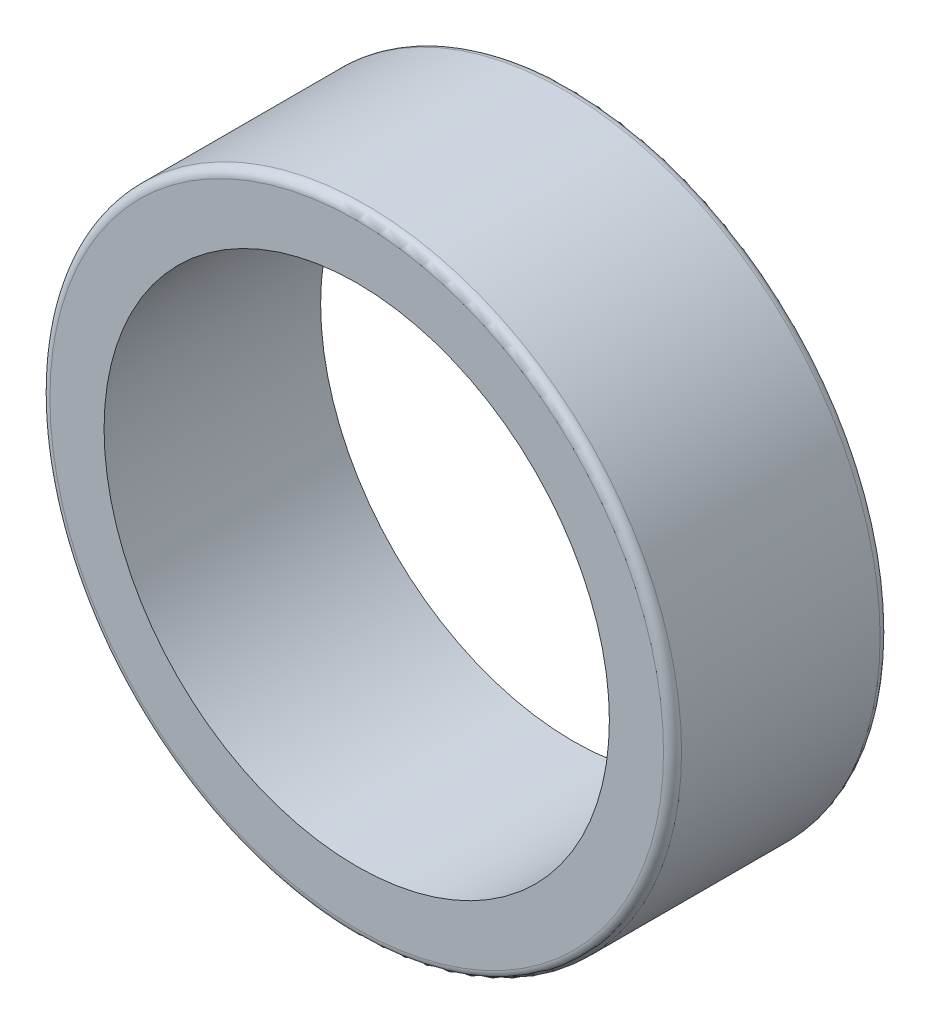
ISO-10303-21;
HEADER;
FILE_DESCRIPTION(('STEP AP214'),'2;1');
FILE_NAME('part.step','',(''),(''),'','','');
FILE_SCHEMA(('AUTOMOTIVE_DESIGN { 1 0 10303 214 1 1 1 1 }'));
ENDSEC;
DATA;
#1=APPLICATION_CONTEXT('core data for automotive mechanical design processes');
#2=APPLICATION_PROTOCOL_DEFINITION('international standard','automotive_design',2000,#1);
#3=PRODUCT_CONTEXT('',#1,'mechanical');
#4=PRODUCT('Part','Part','',(#3));
#5=PRODUCT_RELATED_PRODUCT_CATEGORY('part','',(#4));
#6=PRODUCT_DEFINITION_FORMATION('','',#4);
#7=PRODUCT_DEFINITION_CONTEXT('part definition',#1,'design');
#8=PRODUCT_DEFINITION('design','',#6,#7);
#9=PRODUCT_DEFINITION_SHAPE('','',#8);
#10=(LENGTH_UNIT() NAMED_UNIT(*) SI_UNIT(.MILLI.,.METRE.));
#11=(NAMED_UNIT(*) PLANE_ANGLE_UNIT() SI_UNIT($,.RADIAN.));
#12=(NAMED_UNIT(*) SI_UNIT($,.STERADIAN.) SOLID_ANGLE_UNIT());
#13=UNCERTAINTY_MEASURE_WITH_UNIT(LENGTH_MEASURE(1.E-05),#10,'distance_accuracy_value','');
#14=(GEOMETRIC_REPRESENTATION_CONTEXT(3) GLOBAL_UNCERTAINTY_ASSIGNED_CONTEXT((#13)) GLOBAL_UNIT_ASSIGNED_CONTEXT((#10,
#11,#12)) REPRESENTATION_CONTEXT('',''));
#15=CARTESIAN_POINT('',(0.,0.,0.));
#16=DIRECTION('',(0.,0.,1.));
#17=DIRECTION('',(1.,0.,0.));
#18=AXIS2_PLACEMENT_3D('',#15,#16,#17);
#19=CARTESIAN_POINT('',(0.,0.,12.));
#20=DIRECTION('',(0.,0.,1.));
#21=DIRECTION('',(1.,0.,0.));
#22=AXIS2_PLACEMENT_3D('',#19,#20,#21);
#23=PLANE('',#22);
#24=CARTESIAN_POINT('',(0.,0.,12.));
#25=DIRECTION('',(0.,0.,1.));
#26=DIRECTION('',(1.,0.,0.));
#27=AXIS2_PLACEMENT_3D('',#24,#25,#26);
#28=CIRCLE('',#27,17.);
#29=CARTESIAN_POINT('',(17.,0.,12.));
#30=VERTEX_POINT('',#29);
#31=EDGE_CURVE('E10',#30,#30,#28,.T.);
#32=ORIENTED_EDGE('',*,*,#31,.T.);
#33=EDGE_LOOP('',(#32));
#34=FACE_BOUND('',#33,.T.);
#35=CARTESIAN_POINT('',(0.,0.,12.));
#36=DIRECTION('',(0.,0.,1.));
#37=DIRECTION('',(1.,0.,0.));
#38=AXIS2_PLACEMENT_3D('',#35,#36,#37);
#39=CIRCLE('',#38,14.);
#40=CARTESIAN_POINT('',(14.,0.,12.));
#41=VERTEX_POINT('',#40);
#42=EDGE_CURVE('E50',#41,#41,#39,.T.);
#43=ORIENTED_EDGE('',*,*,#42,.F.);
#44=EDGE_LOOP('',(#43));
#45=FACE_BOUND('',#44,.T.);
#46=ADVANCED_FACE('F30',(#34,#45),#23,.T.);
#47=CARTESIAN_POINT('',(0.,0.,0.));
#48=DIRECTION('',(0.,0.,1.));
#49=DIRECTION('',(1.,0.,0.));
#50=AXIS2_PLACEMENT_3D('',#47,#48,#49);
#51=PLANE('',#50);
#52=CARTESIAN_POINT('',(0.,0.,0.));
#53=DIRECTION('',(0.,0.,1.));
#54=DIRECTION('',(1.,0.,0.));
#55=AXIS2_PLACEMENT_3D('',#52,#53,#54);
#56=CIRCLE('',#55,17.);
#57=CARTESIAN_POINT('',(17.,0.,0.));
#58=VERTEX_POINT('',#57);
#59=EDGE_CURVE('E37',#58,#58,#56,.F.);
#60=ORIENTED_EDGE('',*,*,#59,.T.);
#61=EDGE_LOOP('',(#60));
#62=FACE_BOUND('',#61,.T.);
#63=CARTESIAN_POINT('',(0.,0.,0.));
#64=DIRECTION('',(0.,0.,1.));
#65=DIRECTION('',(1.,0.,0.));
#66=AXIS2_PLACEMENT_3D('',#63,#64,#65);
#67=CIRCLE('',#66,14.);
#68=CARTESIAN_POINT('',(14.,0.,0.));
#69=VERTEX_POINT('',#68);
#70=EDGE_CURVE('E51',#69,#69,#67,.T.);
#71=ORIENTED_EDGE('',*,*,#70,.T.);
#72=EDGE_LOOP('',(#71));
#73=FACE_BOUND('',#72,.T.);
#74=ADVANCED_FACE('F61',(#62,#73),#51,.F.);
#75=CARTESIAN_POINT('',(0.,0.,12.));
#76=DIRECTION('',(0.,0.,-1.));
#77=DIRECTION('',(-1.,0.,0.));
#78=AXIS2_PLACEMENT_3D('',#75,#76,#77);
#79=CYLINDRICAL_SURFACE('',#78,17.5);
#80=CARTESIAN_POINT('',(0.,0.,0.5));
#81=DIRECTION('',(0.,0.,1.));
#82=DIRECTION('',(1.,0.,0.));
#83=AXIS2_PLACEMENT_3D('',#80,#81,#82);
#84=CIRCLE('',#83,17.5);
#85=CARTESIAN_POINT('',(17.5,0.,0.5));
#86=VERTEX_POINT('',#85);
#87=EDGE_CURVE('E41',#86,#86,#84,.T.);
#88=ORIENTED_EDGE('',*,*,#87,.T.);
#89=EDGE_LOOP('',(#88));
#90=FACE_BOUND('',#89,.T.);
#91=CARTESIAN_POINT('',(0.,0.,11.5));
#92=DIRECTION('',(0.,0.,1.));
#93=DIRECTION('',(1.,0.,0.));
#94=AXIS2_PLACEMENT_3D('',#91,#92,#93);
#95=CIRCLE('',#94,17.5);
#96=CARTESIAN_POINT('',(17.5,0.,11.5));
#97=VERTEX_POINT('',#96);
#98=EDGE_CURVE('E45',#97,#97,#95,.F.);
#99=ORIENTED_EDGE('',*,*,#98,.T.);
#100=EDGE_LOOP('',(#99));
#101=FACE_BOUND('',#100,.T.);
#102=ADVANCED_FACE('F66',(#90,#101),#79,.T.);
#103=CARTESIAN_POINT('',(0.,0.,12.));
#104=DIRECTION('',(0.,0.,-1.));
#105=DIRECTION('',(-1.,0.,0.));
#106=AXIS2_PLACEMENT_3D('',#103,#104,#105);
#107=CYLINDRICAL_SURFACE('',#106,14.);
#108=ORIENTED_EDGE('',*,*,#42,.T.);
#109=EDGE_LOOP('',(#108));
#110=FACE_BOUND('',#109,.T.);
#111=ORIENTED_EDGE('',*,*,#70,.F.);
#112=EDGE_LOOP('',(#111));
#113=FACE_BOUND('',#112,.T.);
#114=ADVANCED_FACE('F57',(#110,#113),#107,.F.);
#115=CARTESIAN_POINT('',(0.,0.,0.5));
#116=DIRECTION('',(0.,0.,1.));
#117=DIRECTION('',(1.,0.,0.));
#118=AXIS2_PLACEMENT_3D('',#115,#116,#117);
#119=TOROIDAL_SURFACE('',#118,17.,0.5);
#120=ORIENTED_EDGE('',*,*,#59,.F.);
#121=EDGE_LOOP('',(#120));
#122=FACE_BOUND('',#121,.T.);
#123=ORIENTED_EDGE('',*,*,#87,.F.);
#124=EDGE_LOOP('',(#123));
#125=FACE_BOUND('',#124,.T.);
#126=ADVANCED_FACE('F72',(#122,#125),#119,.T.);
#127=CARTESIAN_POINT('',(0.,0.,11.5));
#128=DIRECTION('',(0.,0.,1.));
#129=DIRECTION('',(1.,0.,0.));
#130=AXIS2_PLACEMENT_3D('',#127,#128,#129);
#131=TOROIDAL_SURFACE('',#130,17.,0.5);
#132=ORIENTED_EDGE('',*,*,#98,.F.);
#133=EDGE_LOOP('',(#132));
#134=FACE_BOUND('',#133,.T.);
#135=ORIENTED_EDGE('',*,*,#31,.F.);
#136=EDGE_LOOP('',(#135));
#137=FACE_BOUND('',#136,.T.);
#138=ADVANCED_FACE('F32',(#134,#137),#131,.T.);
#139=CLOSED_SHELL('',(#46,#74,#102,#114,#126,#138));
#140=MANIFOLD_SOLID_BREP('B2',#139);
#141=ADVANCED_BREP_SHAPE_REPRESENTATION('',(#18,#140),#14);
#142=SHAPE_DEFINITION_REPRESENTATION(#9,#141);
ENDSEC;
END-ISO-10303-21;
